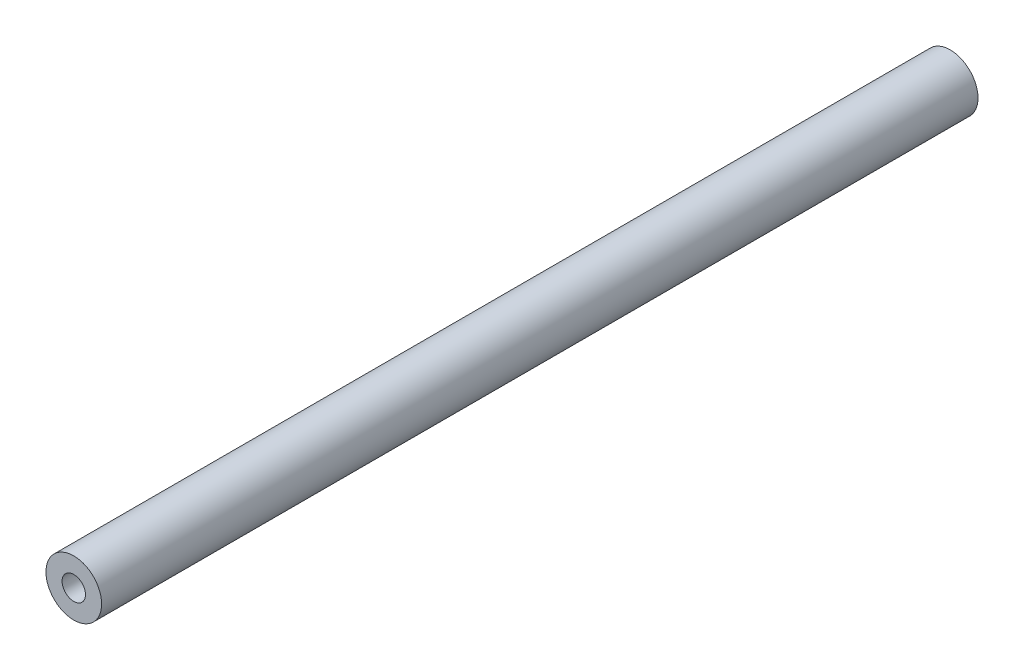
ISO-10303-21;
HEADER;
FILE_DESCRIPTION(('STEP AP214'),'2;1');
FILE_NAME('part.step','',(''),(''),'','','');
FILE_SCHEMA(('AUTOMOTIVE_DESIGN { 1 0 10303 214 1 1 1 1 }'));
ENDSEC;
DATA;
#1=APPLICATION_CONTEXT('core data for automotive mechanical design processes');
#2=APPLICATION_PROTOCOL_DEFINITION('international standard','automotive_design',2000,#1);
#3=PRODUCT_CONTEXT('',#1,'mechanical');
#4=PRODUCT('Part','Part','',(#3));
#5=PRODUCT_RELATED_PRODUCT_CATEGORY('part','',(#4));
#6=PRODUCT_DEFINITION_FORMATION('','',#4);
#7=PRODUCT_DEFINITION_CONTEXT('part definition',#1,'design');
#8=PRODUCT_DEFINITION('design','',#6,#7);
#9=PRODUCT_DEFINITION_SHAPE('','',#8);
#10=(LENGTH_UNIT() NAMED_UNIT(*) SI_UNIT(.MILLI.,.METRE.));
#11=(NAMED_UNIT(*) PLANE_ANGLE_UNIT() SI_UNIT($,.RADIAN.));
#12=(NAMED_UNIT(*) SI_UNIT($,.STERADIAN.) SOLID_ANGLE_UNIT());
#13=UNCERTAINTY_MEASURE_WITH_UNIT(LENGTH_MEASURE(1.E-05),#10,'distance_accuracy_value','');
#14=(GEOMETRIC_REPRESENTATION_CONTEXT(3) GLOBAL_UNCERTAINTY_ASSIGNED_CONTEXT((#13)) GLOBAL_UNIT_ASSIGNED_CONTEXT((#10,
#11,#12)) REPRESENTATION_CONTEXT('',''));
#15=CARTESIAN_POINT('',(0.,0.,0.));
#16=DIRECTION('',(0.,0.,1.));
#17=DIRECTION('',(1.,0.,0.));
#18=AXIS2_PLACEMENT_3D('',#15,#16,#17);
#19=CARTESIAN_POINT('',(0.,0.,150.));
#20=DIRECTION('',(0.,0.,1.));
#21=DIRECTION('',(1.,0.,0.));
#22=AXIS2_PLACEMENT_3D('',#19,#20,#21);
#23=PLANE('',#22);
#24=CARTESIAN_POINT('',(0.,0.,150.));
#25=DIRECTION('',(0.,0.,1.));
#26=DIRECTION('',(1.,0.,0.));
#27=AXIS2_PLACEMENT_3D('',#24,#25,#26);
#28=CIRCLE('',#27,4.7625);
#29=CARTESIAN_POINT('',(4.7625,0.,150.));
#30=VERTEX_POINT('',#29);
#31=EDGE_CURVE('E10',#30,#30,#28,.T.);
#32=ORIENTED_EDGE('',*,*,#31,.T.);
#33=EDGE_LOOP('',(#32));
#34=FACE_BOUND('',#33,.T.);
#35=CARTESIAN_POINT('',(0.,0.,150.));
#36=DIRECTION('',(0.,0.,1.));
#37=DIRECTION('',(1.,0.,0.));
#38=AXIS2_PLACEMENT_3D('',#35,#36,#37);
#39=CIRCLE('',#38,2.);
#40=CARTESIAN_POINT('',(2.,0.,150.));
#41=VERTEX_POINT('',#40);
#42=EDGE_CURVE('E50',#41,#41,#39,.T.);
#43=ORIENTED_EDGE('',*,*,#42,.F.);
#44=EDGE_LOOP('',(#43));
#45=FACE_BOUND('',#44,.T.);
#46=ADVANCED_FACE('F37',(#34,#45),#23,.T.);
#47=CARTESIAN_POINT('',(0.,0.,0.));
#48=DIRECTION('',(0.,0.,1.));
#49=DIRECTION('',(1.,0.,0.));
#50=AXIS2_PLACEMENT_3D('',#47,#48,#49);
#51=PLANE('',#50);
#52=CARTESIAN_POINT('',(0.,0.,0.));
#53=DIRECTION('',(0.,0.,1.));
#54=DIRECTION('',(1.,0.,0.));
#55=AXIS2_PLACEMENT_3D('',#52,#53,#54);
#56=CIRCLE('',#55,4.7625);
#57=CARTESIAN_POINT('',(4.7625,0.,0.));
#58=VERTEX_POINT('',#57);
#59=EDGE_CURVE('E41',#58,#58,#56,.T.);
#60=ORIENTED_EDGE('',*,*,#59,.F.);
#61=EDGE_LOOP('',(#60));
#62=FACE_BOUND('',#61,.T.);
#63=CARTESIAN_POINT('',(0.,0.,0.));
#64=DIRECTION('',(0.,0.,1.));
#65=DIRECTION('',(1.,0.,0.));
#66=AXIS2_PLACEMENT_3D('',#63,#64,#65);
#67=CIRCLE('',#66,2.);
#68=CARTESIAN_POINT('',(2.,0.,0.));
#69=VERTEX_POINT('',#68);
#70=EDGE_CURVE('E52',#69,#69,#67,.T.);
#71=ORIENTED_EDGE('',*,*,#70,.T.);
#72=EDGE_LOOP('',(#71));
#73=FACE_BOUND('',#72,.T.);
#74=ADVANCED_FACE('F64',(#62,#73),#51,.F.);
#75=CARTESIAN_POINT('',(0.,0.,150.));
#76=DIRECTION('',(0.,0.,-1.));
#77=DIRECTION('',(-1.,0.,0.));
#78=AXIS2_PLACEMENT_3D('',#75,#76,#77);
#79=CYLINDRICAL_SURFACE('',#78,4.7625);
#80=ORIENTED_EDGE('',*,*,#31,.F.);
#81=EDGE_LOOP('',(#80));
#82=FACE_BOUND('',#81,.T.);
#83=ORIENTED_EDGE('',*,*,#59,.T.);
#84=EDGE_LOOP('',(#83));
#85=FACE_BOUND('',#84,.T.);
#86=ADVANCED_FACE('F39',(#82,#85),#79,.T.);
#87=CARTESIAN_POINT('',(0.,0.,150.));
#88=DIRECTION('',(0.,0.,-1.));
#89=DIRECTION('',(-1.,0.,0.));
#90=AXIS2_PLACEMENT_3D('',#87,#88,#89);
#91=CYLINDRICAL_SURFACE('',#90,2.);
#92=ORIENTED_EDGE('',*,*,#42,.T.);
#93=EDGE_LOOP('',(#92));
#94=FACE_BOUND('',#93,.T.);
#95=ORIENTED_EDGE('',*,*,#70,.F.);
#96=EDGE_LOOP('',(#95));
#97=FACE_BOUND('',#96,.T.);
#98=ADVANCED_FACE('F60',(#94,#97),#91,.F.);
#99=CLOSED_SHELL('',(#46,#74,#86,#98));
#100=MANIFOLD_SOLID_BREP('B2',#99);
#101=ADVANCED_BREP_SHAPE_REPRESENTATION('',(#18,#100),#14);
#102=SHAPE_DEFINITION_REPRESENTATION(#9,#101);
ENDSEC;
END-ISO-10303-21;
